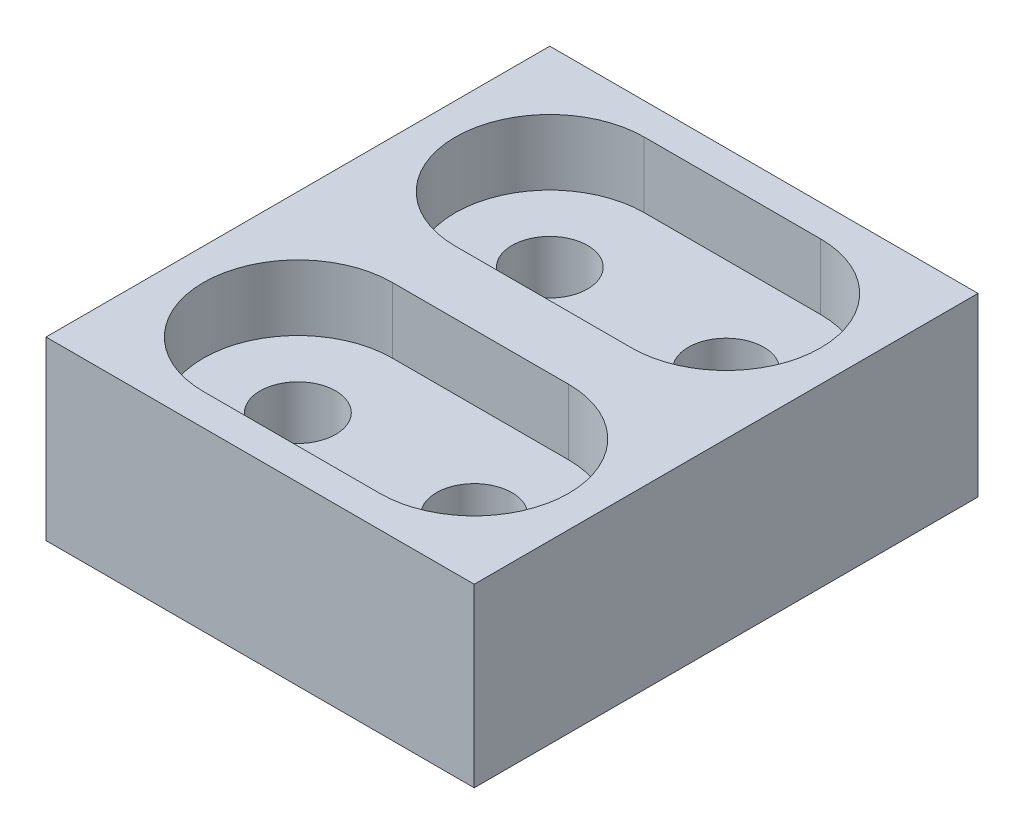
ISO-10303-21;
HEADER;
FILE_DESCRIPTION(('STEP AP214'),'2;1');
FILE_NAME('part.step','',(''),(''),'','','');
FILE_SCHEMA(('AUTOMOTIVE_DESIGN { 1 0 10303 214 1 1 1 1 }'));
ENDSEC;
DATA;
#1=APPLICATION_CONTEXT('core data for automotive mechanical design processes');
#2=APPLICATION_PROTOCOL_DEFINITION('international standard','automotive_design',2000,#1);
#3=PRODUCT_CONTEXT('',#1,'mechanical');
#4=PRODUCT('Part','Part','',(#3));
#5=PRODUCT_RELATED_PRODUCT_CATEGORY('part','',(#4));
#6=PRODUCT_DEFINITION_FORMATION('','',#4);
#7=PRODUCT_DEFINITION_CONTEXT('part definition',#1,'design');
#8=PRODUCT_DEFINITION('design','',#6,#7);
#9=PRODUCT_DEFINITION_SHAPE('','',#8);
#10=(LENGTH_UNIT() NAMED_UNIT(*) SI_UNIT(.MILLI.,.METRE.));
#11=(NAMED_UNIT(*) PLANE_ANGLE_UNIT() SI_UNIT($,.RADIAN.));
#12=(NAMED_UNIT(*) SI_UNIT($,.STERADIAN.) SOLID_ANGLE_UNIT());
#13=UNCERTAINTY_MEASURE_WITH_UNIT(LENGTH_MEASURE(1.E-05),#10,'distance_accuracy_value','');
#14=(GEOMETRIC_REPRESENTATION_CONTEXT(3) GLOBAL_UNCERTAINTY_ASSIGNED_CONTEXT((#13)) GLOBAL_UNIT_ASSIGNED_CONTEXT((#10,
#11,#12)) REPRESENTATION_CONTEXT('',''));
#15=CARTESIAN_POINT('',(0.,0.,0.));
#16=DIRECTION('',(0.,0.,1.));
#17=DIRECTION('',(1.,0.,0.));
#18=AXIS2_PLACEMENT_3D('',#15,#16,#17);
#19=CARTESIAN_POINT('',(-7.,7.,10.));
#20=DIRECTION('',(0.,-1.,0.));
#21=DIRECTION('',(0.,0.,-1.));
#22=AXIS2_PLACEMENT_3D('',#19,#20,#21);
#23=CYLINDRICAL_SURFACE('',#22,1.5);
#24=CARTESIAN_POINT('',(-7.,0.,10.));
#25=DIRECTION('',(0.,1.,0.));
#26=DIRECTION('',(0.,0.,1.));
#27=AXIS2_PLACEMENT_3D('',#24,#25,#26);
#28=CIRCLE('',#27,1.5);
#29=CARTESIAN_POINT('',(-7.,0.,11.5));
#30=VERTEX_POINT('',#29);
#31=EDGE_CURVE('E280',#30,#30,#28,.T.);
#32=ORIENTED_EDGE('',*,*,#31,.F.);
#33=EDGE_LOOP('',(#32));
#34=FACE_BOUND('',#33,.T.);
#35=CARTESIAN_POINT('',(-7.,4.4,10.));
#36=DIRECTION('',(0.,1.,0.));
#37=DIRECTION('',(0.,0.,1.));
#38=AXIS2_PLACEMENT_3D('',#35,#36,#37);
#39=CIRCLE('',#38,1.5);
#40=CARTESIAN_POINT('',(-7.,4.4,11.5));
#41=VERTEX_POINT('',#40);
#42=EDGE_CURVE('E207',#41,#41,#39,.F.);
#43=ORIENTED_EDGE('',*,*,#42,.F.);
#44=EDGE_LOOP('',(#43));
#45=FACE_BOUND('',#44,.T.);
#46=ADVANCED_FACE('F41',(#34,#45),#23,.F.);
#47=CARTESIAN_POINT('',(0.,7.,0.));
#48=DIRECTION('',(0.,-1.,0.));
#49=DIRECTION('',(0.,0.,-1.));
#50=AXIS2_PLACEMENT_3D('',#47,#48,#49);
#51=CYLINDRICAL_SURFACE('',#50,1.5);
#52=CARTESIAN_POINT('',(0.,0.,0.));
#53=DIRECTION('',(0.,1.,0.));
#54=DIRECTION('',(0.,0.,1.));
#55=AXIS2_PLACEMENT_3D('',#52,#53,#54);
#56=CIRCLE('',#55,1.5);
#57=CARTESIAN_POINT('',(0.,0.,1.5));
#58=VERTEX_POINT('',#57);
#59=EDGE_CURVE('E260',#58,#58,#56,.T.);
#60=ORIENTED_EDGE('',*,*,#59,.F.);
#61=EDGE_LOOP('',(#60));
#62=FACE_BOUND('',#61,.T.);
#63=CARTESIAN_POINT('',(0.,4.4,0.));
#64=DIRECTION('',(0.,1.,0.));
#65=DIRECTION('',(0.,0.,1.));
#66=AXIS2_PLACEMENT_3D('',#63,#64,#65);
#67=CIRCLE('',#66,1.5);
#68=CARTESIAN_POINT('',(0.,4.4,1.5));
#69=VERTEX_POINT('',#68);
#70=EDGE_CURVE('E139',#69,#69,#67,.F.);
#71=ORIENTED_EDGE('',*,*,#70,.F.);
#72=EDGE_LOOP('',(#71));
#73=FACE_BOUND('',#72,.T.);
#74=ADVANCED_FACE('F324',(#62,#73),#51,.F.);
#75=CARTESIAN_POINT('',(0.,7.,10.));
#76=DIRECTION('',(0.,-1.,0.));
#77=DIRECTION('',(0.,0.,-1.));
#78=AXIS2_PLACEMENT_3D('',#75,#76,#77);
#79=CYLINDRICAL_SURFACE('',#78,1.5);
#80=CARTESIAN_POINT('',(0.,0.,10.));
#81=DIRECTION('',(0.,1.,0.));
#82=DIRECTION('',(0.,0.,1.));
#83=AXIS2_PLACEMENT_3D('',#80,#81,#82);
#84=CIRCLE('',#83,1.5);
#85=CARTESIAN_POINT('',(0.,0.,11.5));
#86=VERTEX_POINT('',#85);
#87=EDGE_CURVE('E185',#86,#86,#84,.T.);
#88=ORIENTED_EDGE('',*,*,#87,.F.);
#89=EDGE_LOOP('',(#88));
#90=FACE_BOUND('',#89,.T.);
#91=CARTESIAN_POINT('',(0.,4.4,10.));
#92=DIRECTION('',(0.,1.,0.));
#93=DIRECTION('',(0.,0.,1.));
#94=AXIS2_PLACEMENT_3D('',#91,#92,#93);
#95=CIRCLE('',#94,1.5);
#96=CARTESIAN_POINT('',(0.,4.4,11.5));
#97=VERTEX_POINT('',#96);
#98=EDGE_CURVE('E211',#97,#97,#95,.F.);
#99=ORIENTED_EDGE('',*,*,#98,.F.);
#100=EDGE_LOOP('',(#99));
#101=FACE_BOUND('',#100,.T.);
#102=ADVANCED_FACE('F43',(#90,#101),#79,.F.);
#103=CARTESIAN_POINT('',(-7.,7.,0.));
#104=DIRECTION('',(0.,-1.,0.));
#105=DIRECTION('',(0.,0.,-1.));
#106=AXIS2_PLACEMENT_3D('',#103,#104,#105);
#107=CYLINDRICAL_SURFACE('',#106,1.5);
#108=CARTESIAN_POINT('',(-7.,0.,0.));
#109=DIRECTION('',(0.,1.,0.));
#110=DIRECTION('',(0.,0.,1.));
#111=AXIS2_PLACEMENT_3D('',#108,#109,#110);
#112=CIRCLE('',#111,1.5);
#113=CARTESIAN_POINT('',(-7.,0.,1.5));
#114=VERTEX_POINT('',#113);
#115=EDGE_CURVE('E244',#114,#114,#112,.T.);
#116=ORIENTED_EDGE('',*,*,#115,.F.);
#117=EDGE_LOOP('',(#116));
#118=FACE_BOUND('',#117,.T.);
#119=CARTESIAN_POINT('',(-7.,4.4,0.));
#120=DIRECTION('',(0.,1.,0.));
#121=DIRECTION('',(0.,0.,1.));
#122=AXIS2_PLACEMENT_3D('',#119,#120,#121);
#123=CIRCLE('',#122,1.5);
#124=CARTESIAN_POINT('',(-7.,4.4,1.5));
#125=VERTEX_POINT('',#124);
#126=EDGE_CURVE('E166',#125,#125,#123,.F.);
#127=ORIENTED_EDGE('',*,*,#126,.F.);
#128=EDGE_LOOP('',(#127));
#129=FACE_BOUND('',#128,.T.);
#130=ADVANCED_FACE('F314',(#118,#129),#107,.F.);
#131=CARTESIAN_POINT('',(0.,7.,15.));
#132=DIRECTION('',(0.,0.,1.));
#133=DIRECTION('',(1.,0.,0.));
#134=AXIS2_PLACEMENT_3D('',#131,#132,#133);
#135=PLANE('',#134);
#136=DIRECTION('',(-1.,0.,0.));
#137=VECTOR('',#136,1.);
#138=CARTESIAN_POINT('',(0.,0.,15.));
#139=LINE('',#138,#137);
#140=CARTESIAN_POINT('',(5.,0.,15.));
#141=VERTEX_POINT('',#140);
#142=CARTESIAN_POINT('',(-12.,0.,15.));
#143=VERTEX_POINT('',#142);
#144=EDGE_CURVE('E264',#141,#143,#139,.T.);
#145=ORIENTED_EDGE('',*,*,#144,.F.);
#146=DIRECTION('',(0.,-1.,0.));
#147=VECTOR('',#146,1.);
#148=CARTESIAN_POINT('',(5.,7.,15.));
#149=LINE('',#148,#147);
#150=CARTESIAN_POINT('',(5.,7.,15.));
#151=VERTEX_POINT('',#150);
#152=EDGE_CURVE('E11',#151,#141,#149,.T.);
#153=ORIENTED_EDGE('',*,*,#152,.F.);
#154=DIRECTION('',(-1.,0.,0.));
#155=VECTOR('',#154,1.);
#156=CARTESIAN_POINT('',(0.,7.,15.));
#157=LINE('',#156,#155);
#158=CARTESIAN_POINT('',(-12.,7.,15.));
#159=VERTEX_POINT('',#158);
#160=EDGE_CURVE('E239',#151,#159,#157,.T.);
#161=ORIENTED_EDGE('',*,*,#160,.T.);
#162=DIRECTION('',(0.,-1.,0.));
#163=VECTOR('',#162,1.);
#164=CARTESIAN_POINT('',(-12.,7.,15.));
#165=LINE('',#164,#163);
#166=EDGE_CURVE('E256',#159,#143,#165,.T.);
#167=ORIENTED_EDGE('',*,*,#166,.T.);
#168=EDGE_LOOP('',(#145,#153,#161,#167));
#169=FACE_BOUND('',#168,.T.);
#170=ADVANCED_FACE('F312',(#169),#135,.T.);
#171=CARTESIAN_POINT('',(5.,7.,0.));
#172=DIRECTION('',(1.,0.,0.));
#173=DIRECTION('',(0.,0.,-1.));
#174=AXIS2_PLACEMENT_3D('',#171,#172,#173);
#175=PLANE('',#174);
#176=DIRECTION('',(0.,0.,1.));
#177=VECTOR('',#176,1.);
#178=CARTESIAN_POINT('',(5.,0.,0.));
#179=LINE('',#178,#177);
#180=CARTESIAN_POINT('',(5.,0.,-5.));
#181=VERTEX_POINT('',#180);
#182=EDGE_CURVE('E268',#181,#141,#179,.T.);
#183=ORIENTED_EDGE('',*,*,#182,.F.);
#184=DIRECTION('',(0.,-1.,0.));
#185=VECTOR('',#184,1.);
#186=CARTESIAN_POINT('',(5.,7.,-5.));
#187=LINE('',#186,#185);
#188=CARTESIAN_POINT('',(5.,7.,-5.));
#189=VERTEX_POINT('',#188);
#190=EDGE_CURVE('E50',#189,#181,#187,.T.);
#191=ORIENTED_EDGE('',*,*,#190,.F.);
#192=DIRECTION('',(0.,0.,1.));
#193=VECTOR('',#192,1.);
#194=CARTESIAN_POINT('',(5.,7.,0.));
#195=LINE('',#194,#193);
#196=EDGE_CURVE('E243',#189,#151,#195,.T.);
#197=ORIENTED_EDGE('',*,*,#196,.T.);
#198=ORIENTED_EDGE('',*,*,#152,.T.);
#199=EDGE_LOOP('',(#183,#191,#197,#198));
#200=FACE_BOUND('',#199,.T.);
#201=ADVANCED_FACE('F299',(#200),#175,.T.);
#202=CARTESIAN_POINT('',(0.,7.,-5.));
#203=DIRECTION('',(0.,0.,-1.));
#204=DIRECTION('',(-1.,0.,0.));
#205=AXIS2_PLACEMENT_3D('',#202,#203,#204);
#206=PLANE('',#205);
#207=DIRECTION('',(1.,0.,0.));
#208=VECTOR('',#207,1.);
#209=CARTESIAN_POINT('',(0.,0.,-5.));
#210=LINE('',#209,#208);
#211=CARTESIAN_POINT('',(-12.,0.,-5.));
#212=VERTEX_POINT('',#211);
#213=EDGE_CURVE('E272',#212,#181,#210,.T.);
#214=ORIENTED_EDGE('',*,*,#213,.F.);
#215=DIRECTION('',(0.,-1.,0.));
#216=VECTOR('',#215,1.);
#217=CARTESIAN_POINT('',(-12.,7.,-5.));
#218=LINE('',#217,#216);
#219=CARTESIAN_POINT('',(-12.,7.,-5.));
#220=VERTEX_POINT('',#219);
#221=EDGE_CURVE('E289',#220,#212,#218,.T.);
#222=ORIENTED_EDGE('',*,*,#221,.F.);
#223=DIRECTION('',(1.,0.,0.));
#224=VECTOR('',#223,1.);
#225=CARTESIAN_POINT('',(0.,7.,-5.));
#226=LINE('',#225,#224);
#227=EDGE_CURVE('E248',#220,#189,#226,.T.);
#228=ORIENTED_EDGE('',*,*,#227,.T.);
#229=ORIENTED_EDGE('',*,*,#190,.T.);
#230=EDGE_LOOP('',(#214,#222,#228,#229));
#231=FACE_BOUND('',#230,.T.);
#232=ADVANCED_FACE('F295',(#231),#206,.T.);
#233=CARTESIAN_POINT('',(-12.,7.,0.));
#234=DIRECTION('',(-1.,0.,0.));
#235=DIRECTION('',(0.,0.,1.));
#236=AXIS2_PLACEMENT_3D('',#233,#234,#235);
#237=PLANE('',#236);
#238=DIRECTION('',(0.,0.,-1.));
#239=VECTOR('',#238,1.);
#240=CARTESIAN_POINT('',(-12.,0.,0.));
#241=LINE('',#240,#239);
#242=EDGE_CURVE('E276',#143,#212,#241,.T.);
#243=ORIENTED_EDGE('',*,*,#242,.F.);
#244=ORIENTED_EDGE('',*,*,#166,.F.);
#245=DIRECTION('',(0.,0.,-1.));
#246=VECTOR('',#245,1.);
#247=CARTESIAN_POINT('',(-12.,7.,0.));
#248=LINE('',#247,#246);
#249=EDGE_CURVE('E252',#159,#220,#248,.T.);
#250=ORIENTED_EDGE('',*,*,#249,.T.);
#251=ORIENTED_EDGE('',*,*,#221,.T.);
#252=EDGE_LOOP('',(#243,#244,#250,#251));
#253=FACE_BOUND('',#252,.T.);
#254=ADVANCED_FACE('F306',(#253),#237,.T.);
#255=CARTESIAN_POINT('',(0.,7.,0.));
#256=DIRECTION('',(0.,1.,0.));
#257=DIRECTION('',(0.,0.,1.));
#258=AXIS2_PLACEMENT_3D('',#255,#256,#257);
#259=PLANE('',#258);
#260=DIRECTION('',(1.,0.,0.));
#261=VECTOR('',#260,1.);
#262=CARTESIAN_POINT('',(0.,7.,3.75));
#263=LINE('',#262,#261);
#264=CARTESIAN_POINT('',(-7.,7.,3.75));
#265=VERTEX_POINT('',#264);
#266=CARTESIAN_POINT('',(0.,7.,3.75));
#267=VERTEX_POINT('',#266);
#268=EDGE_CURVE('E57',#265,#267,#263,.T.);
#269=ORIENTED_EDGE('',*,*,#268,.F.);
#270=CARTESIAN_POINT('',(-7.,7.,0.));
#271=DIRECTION('',(0.,1.,0.));
#272=DIRECTION('',(0.,0.,1.));
#273=AXIS2_PLACEMENT_3D('',#270,#271,#272);
#274=CIRCLE('',#273,3.75);
#275=CARTESIAN_POINT('',(-7.,7.,-3.75));
#276=VERTEX_POINT('',#275);
#277=EDGE_CURVE('E155',#276,#265,#274,.T.);
#278=ORIENTED_EDGE('',*,*,#277,.F.);
#279=DIRECTION('',(1.,0.,0.));
#280=VECTOR('',#279,1.);
#281=CARTESIAN_POINT('',(0.,7.,-3.75));
#282=LINE('',#281,#280);
#283=CARTESIAN_POINT('',(0.,7.,-3.75));
#284=VERTEX_POINT('',#283);
#285=EDGE_CURVE('E159',#276,#284,#282,.T.);
#286=ORIENTED_EDGE('',*,*,#285,.T.);
#287=CARTESIAN_POINT('',(0.,7.,0.));
#288=DIRECTION('',(0.,1.,0.));
#289=DIRECTION('',(0.,0.,1.));
#290=AXIS2_PLACEMENT_3D('',#287,#288,#289);
#291=CIRCLE('',#290,3.75);
#292=EDGE_CURVE('E175',#267,#284,#291,.T.);
#293=ORIENTED_EDGE('',*,*,#292,.F.);
#294=EDGE_LOOP('',(#269,#278,#286,#293));
#295=FACE_BOUND('',#294,.T.);
#296=DIRECTION('',(1.,0.,0.));
#297=VECTOR('',#296,1.);
#298=CARTESIAN_POINT('',(0.,7.,13.75));
#299=LINE('',#298,#297);
#300=CARTESIAN_POINT('',(-7.,7.,13.75));
#301=VERTEX_POINT('',#300);
#302=CARTESIAN_POINT('',(0.,7.,13.75));
#303=VERTEX_POINT('',#302);
#304=EDGE_CURVE('E65',#301,#303,#299,.T.);
#305=ORIENTED_EDGE('',*,*,#304,.F.);
#306=CARTESIAN_POINT('',(-7.,7.,10.));
#307=DIRECTION('',(0.,1.,0.));
#308=DIRECTION('',(0.,0.,1.));
#309=AXIS2_PLACEMENT_3D('',#306,#307,#308);
#310=CIRCLE('',#309,3.75);
#311=CARTESIAN_POINT('',(-7.,7.,6.25));
#312=VERTEX_POINT('',#311);
#313=EDGE_CURVE('E196',#312,#301,#310,.T.);
#314=ORIENTED_EDGE('',*,*,#313,.F.);
#315=DIRECTION('',(1.,0.,0.));
#316=VECTOR('',#315,1.);
#317=CARTESIAN_POINT('',(0.,7.,6.25));
#318=LINE('',#317,#316);
#319=CARTESIAN_POINT('',(0.,7.,6.25));
#320=VERTEX_POINT('',#319);
#321=EDGE_CURVE('E222',#312,#320,#318,.T.);
#322=ORIENTED_EDGE('',*,*,#321,.T.);
#323=CARTESIAN_POINT('',(0.,7.,10.));
#324=DIRECTION('',(0.,1.,0.));
#325=DIRECTION('',(0.,0.,1.));
#326=AXIS2_PLACEMENT_3D('',#323,#324,#325);
#327=CIRCLE('',#326,3.75);
#328=EDGE_CURVE('E218',#303,#320,#327,.T.);
#329=ORIENTED_EDGE('',*,*,#328,.F.);
#330=EDGE_LOOP('',(#305,#314,#322,#329));
#331=FACE_BOUND('',#330,.T.);
#332=ORIENTED_EDGE('',*,*,#160,.F.);
#333=ORIENTED_EDGE('',*,*,#196,.F.);
#334=ORIENTED_EDGE('',*,*,#227,.F.);
#335=ORIENTED_EDGE('',*,*,#249,.F.);
#336=EDGE_LOOP('',(#332,#333,#334,#335));
#337=FACE_BOUND('',#336,.T.);
#338=ADVANCED_FACE('F310',(#295,#331,#337),#259,.T.);
#339=CARTESIAN_POINT('',(0.,0.,0.));
#340=DIRECTION('',(0.,1.,0.));
#341=DIRECTION('',(0.,0.,1.));
#342=AXIS2_PLACEMENT_3D('',#339,#340,#341);
#343=PLANE('',#342);
#344=ORIENTED_EDGE('',*,*,#87,.T.);
#345=EDGE_LOOP('',(#344));
#346=FACE_BOUND('',#345,.T.);
#347=ORIENTED_EDGE('',*,*,#59,.T.);
#348=EDGE_LOOP('',(#347));
#349=FACE_BOUND('',#348,.T.);
#350=ORIENTED_EDGE('',*,*,#144,.T.);
#351=ORIENTED_EDGE('',*,*,#242,.T.);
#352=ORIENTED_EDGE('',*,*,#213,.T.);
#353=ORIENTED_EDGE('',*,*,#182,.T.);
#354=EDGE_LOOP('',(#350,#351,#352,#353));
#355=FACE_BOUND('',#354,.T.);
#356=ORIENTED_EDGE('',*,*,#31,.T.);
#357=EDGE_LOOP('',(#356));
#358=FACE_BOUND('',#357,.T.);
#359=ORIENTED_EDGE('',*,*,#115,.T.);
#360=EDGE_LOOP('',(#359));
#361=FACE_BOUND('',#360,.T.);
#362=ADVANCED_FACE('F302',(#346,#349,#355,#358,#361),#343,.F.);
#363=CARTESIAN_POINT('',(0.,4.4,13.75));
#364=DIRECTION('',(0.,0.,1.));
#365=DIRECTION('',(1.,0.,0.));
#366=AXIS2_PLACEMENT_3D('',#363,#364,#365);
#367=PLANE('',#366);
#368=ORIENTED_EDGE('',*,*,#304,.T.);
#369=DIRECTION('',(0.,1.,0.));
#370=VECTOR('',#369,1.);
#371=CARTESIAN_POINT('',(0.,4.4,13.75));
#372=LINE('',#371,#370);
#373=CARTESIAN_POINT('',(0.,4.4,13.75));
#374=VERTEX_POINT('',#373);
#375=EDGE_CURVE('E215',#374,#303,#372,.T.);
#376=ORIENTED_EDGE('',*,*,#375,.F.);
#377=DIRECTION('',(1.,0.,0.));
#378=VECTOR('',#377,1.);
#379=CARTESIAN_POINT('',(0.,4.4,13.75));
#380=LINE('',#379,#378);
#381=CARTESIAN_POINT('',(-7.,4.4,13.75));
#382=VERTEX_POINT('',#381);
#383=EDGE_CURVE('E191',#382,#374,#380,.T.);
#384=ORIENTED_EDGE('',*,*,#383,.F.);
#385=DIRECTION('',(0.,1.,0.));
#386=VECTOR('',#385,1.);
#387=CARTESIAN_POINT('',(-7.,4.4,13.75));
#388=LINE('',#387,#386);
#389=EDGE_CURVE('E176',#382,#301,#388,.T.);
#390=ORIENTED_EDGE('',*,*,#389,.T.);
#391=EDGE_LOOP('',(#368,#376,#384,#390));
#392=FACE_BOUND('',#391,.T.);
#393=ADVANCED_FACE('F361',(#392),#367,.F.);
#394=CARTESIAN_POINT('',(-7.,4.4,10.));
#395=DIRECTION('',(0.,1.,0.));
#396=DIRECTION('',(0.,0.,1.));
#397=AXIS2_PLACEMENT_3D('',#394,#395,#396);
#398=CYLINDRICAL_SURFACE('',#397,3.75);
#399=ORIENTED_EDGE('',*,*,#313,.T.);
#400=ORIENTED_EDGE('',*,*,#389,.F.);
#401=CARTESIAN_POINT('',(-7.,4.4,10.));
#402=DIRECTION('',(0.,1.,0.));
#403=DIRECTION('',(0.,0.,1.));
#404=AXIS2_PLACEMENT_3D('',#401,#402,#403);
#405=CIRCLE('',#404,3.75);
#406=CARTESIAN_POINT('',(-7.,4.4,6.25));
#407=VERTEX_POINT('',#406);
#408=EDGE_CURVE('E203',#407,#382,#405,.T.);
#409=ORIENTED_EDGE('',*,*,#408,.F.);
#410=DIRECTION('',(0.,1.,0.));
#411=VECTOR('',#410,1.);
#412=CARTESIAN_POINT('',(-7.,4.4,6.25));
#413=LINE('',#412,#411);
#414=EDGE_CURVE('E231',#407,#312,#413,.T.);
#415=ORIENTED_EDGE('',*,*,#414,.T.);
#416=EDGE_LOOP('',(#399,#400,#409,#415));
#417=FACE_BOUND('',#416,.T.);
#418=ADVANCED_FACE('F367',(#417),#398,.F.);
#419=CARTESIAN_POINT('',(0.,4.4,6.25));
#420=DIRECTION('',(0.,0.,1.));
#421=DIRECTION('',(1.,0.,0.));
#422=AXIS2_PLACEMENT_3D('',#419,#420,#421);
#423=PLANE('',#422);
#424=ORIENTED_EDGE('',*,*,#321,.F.);
#425=ORIENTED_EDGE('',*,*,#414,.F.);
#426=DIRECTION('',(1.,0.,0.));
#427=VECTOR('',#426,1.);
#428=CARTESIAN_POINT('',(0.,4.4,6.25));
#429=LINE('',#428,#427);
#430=CARTESIAN_POINT('',(0.,4.4,6.25));
#431=VERTEX_POINT('',#430);
#432=EDGE_CURVE('E200',#407,#431,#429,.T.);
#433=ORIENTED_EDGE('',*,*,#432,.T.);
#434=DIRECTION('',(0.,1.,0.));
#435=VECTOR('',#434,1.);
#436=CARTESIAN_POINT('',(0.,4.4,6.25));
#437=LINE('',#436,#435);
#438=EDGE_CURVE('E234',#431,#320,#437,.T.);
#439=ORIENTED_EDGE('',*,*,#438,.T.);
#440=EDGE_LOOP('',(#424,#425,#433,#439));
#441=FACE_BOUND('',#440,.T.);
#442=ADVANCED_FACE('F374',(#441),#423,.T.);
#443=CARTESIAN_POINT('',(0.,4.4,10.));
#444=DIRECTION('',(0.,1.,0.));
#445=DIRECTION('',(0.,0.,1.));
#446=AXIS2_PLACEMENT_3D('',#443,#444,#445);
#447=CYLINDRICAL_SURFACE('',#446,3.75);
#448=ORIENTED_EDGE('',*,*,#328,.T.);
#449=ORIENTED_EDGE('',*,*,#438,.F.);
#450=CARTESIAN_POINT('',(0.,4.4,10.));
#451=DIRECTION('',(0.,1.,0.));
#452=DIRECTION('',(0.,0.,1.));
#453=AXIS2_PLACEMENT_3D('',#450,#451,#452);
#454=CIRCLE('',#453,3.75);
#455=EDGE_CURVE('E195',#374,#431,#454,.T.);
#456=ORIENTED_EDGE('',*,*,#455,.F.);
#457=ORIENTED_EDGE('',*,*,#375,.T.);
#458=EDGE_LOOP('',(#448,#449,#456,#457));
#459=FACE_BOUND('',#458,.T.);
#460=ADVANCED_FACE('F382',(#459),#447,.F.);
#461=CARTESIAN_POINT('',(0.,4.4,0.));
#462=DIRECTION('',(0.,1.,0.));
#463=DIRECTION('',(0.,0.,1.));
#464=AXIS2_PLACEMENT_3D('',#461,#462,#463);
#465=PLANE('',#464);
#466=ORIENTED_EDGE('',*,*,#383,.T.);
#467=ORIENTED_EDGE('',*,*,#455,.T.);
#468=ORIENTED_EDGE('',*,*,#432,.F.);
#469=ORIENTED_EDGE('',*,*,#408,.T.);
#470=EDGE_LOOP('',(#466,#467,#468,#469));
#471=FACE_BOUND('',#470,.T.);
#472=ORIENTED_EDGE('',*,*,#42,.T.);
#473=EDGE_LOOP('',(#472));
#474=FACE_BOUND('',#473,.T.);
#475=ORIENTED_EDGE('',*,*,#98,.T.);
#476=EDGE_LOOP('',(#475));
#477=FACE_BOUND('',#476,.T.);
#478=ADVANCED_FACE('F390',(#471,#474,#477),#465,.T.);
#479=CARTESIAN_POINT('',(0.,4.4,3.75));
#480=DIRECTION('',(0.,0.,1.));
#481=DIRECTION('',(1.,0.,0.));
#482=AXIS2_PLACEMENT_3D('',#479,#480,#481);
#483=PLANE('',#482);
#484=ORIENTED_EDGE('',*,*,#268,.T.);
#485=DIRECTION('',(0.,1.,0.));
#486=VECTOR('',#485,1.);
#487=CARTESIAN_POINT('',(0.,4.4,3.75));
#488=LINE('',#487,#486);
#489=CARTESIAN_POINT('',(0.,4.4,3.75));
#490=VERTEX_POINT('',#489);
#491=EDGE_CURVE('E128',#490,#267,#488,.T.);
#492=ORIENTED_EDGE('',*,*,#491,.F.);
#493=DIRECTION('',(1.,0.,0.));
#494=VECTOR('',#493,1.);
#495=CARTESIAN_POINT('',(0.,4.4,3.75));
#496=LINE('',#495,#494);
#497=CARTESIAN_POINT('',(-7.,4.4,3.75));
#498=VERTEX_POINT('',#497);
#499=EDGE_CURVE('E132',#498,#490,#496,.T.);
#500=ORIENTED_EDGE('',*,*,#499,.F.);
#501=DIRECTION('',(0.,1.,0.));
#502=VECTOR('',#501,1.);
#503=CARTESIAN_POINT('',(-7.,4.4,3.75));
#504=LINE('',#503,#502);
#505=EDGE_CURVE('E182',#498,#265,#504,.T.);
#506=ORIENTED_EDGE('',*,*,#505,.T.);
#507=EDGE_LOOP('',(#484,#492,#500,#506));
#508=FACE_BOUND('',#507,.T.);
#509=ADVANCED_FACE('F130',(#508),#483,.F.);
#510=CARTESIAN_POINT('',(-7.,4.4,0.));
#511=DIRECTION('',(0.,1.,0.));
#512=DIRECTION('',(0.,0.,1.));
#513=AXIS2_PLACEMENT_3D('',#510,#511,#512);
#514=CYLINDRICAL_SURFACE('',#513,3.75);
#515=ORIENTED_EDGE('',*,*,#277,.T.);
#516=ORIENTED_EDGE('',*,*,#505,.F.);
#517=CARTESIAN_POINT('',(-7.,4.4,0.));
#518=DIRECTION('',(0.,1.,0.));
#519=DIRECTION('',(0.,0.,1.));
#520=AXIS2_PLACEMENT_3D('',#517,#518,#519);
#521=CIRCLE('',#520,3.75);
#522=CARTESIAN_POINT('',(-7.,4.4,-3.75));
#523=VERTEX_POINT('',#522);
#524=EDGE_CURVE('E153',#523,#498,#521,.T.);
#525=ORIENTED_EDGE('',*,*,#524,.F.);
#526=DIRECTION('',(0.,1.,0.));
#527=VECTOR('',#526,1.);
#528=CARTESIAN_POINT('',(-7.,4.4,-3.75));
#529=LINE('',#528,#527);
#530=EDGE_CURVE('E186',#523,#276,#529,.T.);
#531=ORIENTED_EDGE('',*,*,#530,.T.);
#532=EDGE_LOOP('',(#515,#516,#525,#531));
#533=FACE_BOUND('',#532,.T.);
#534=ADVANCED_FACE('F405',(#533),#514,.F.);
#535=CARTESIAN_POINT('',(0.,4.4,-3.75));
#536=DIRECTION('',(0.,0.,1.));
#537=DIRECTION('',(1.,0.,0.));
#538=AXIS2_PLACEMENT_3D('',#535,#536,#537);
#539=PLANE('',#538);
#540=ORIENTED_EDGE('',*,*,#285,.F.);
#541=ORIENTED_EDGE('',*,*,#530,.F.);
#542=DIRECTION('',(1.,0.,0.));
#543=VECTOR('',#542,1.);
#544=CARTESIAN_POINT('',(0.,4.4,-3.75));
#545=LINE('',#544,#543);
#546=CARTESIAN_POINT('',(0.,4.4,-3.75));
#547=VERTEX_POINT('',#546);
#548=EDGE_CURVE('E148',#523,#547,#545,.T.);
#549=ORIENTED_EDGE('',*,*,#548,.T.);
#550=DIRECTION('',(0.,1.,0.));
#551=VECTOR('',#550,1.);
#552=CARTESIAN_POINT('',(0.,4.4,-3.75));
#553=LINE('',#552,#551);
#554=EDGE_CURVE('E138',#547,#284,#553,.T.);
#555=ORIENTED_EDGE('',*,*,#554,.T.);
#556=EDGE_LOOP('',(#540,#541,#549,#555));
#557=FACE_BOUND('',#556,.T.);
#558=ADVANCED_FACE('F412',(#557),#539,.T.);
#559=CARTESIAN_POINT('',(0.,4.4,0.));
#560=DIRECTION('',(0.,1.,0.));
#561=DIRECTION('',(0.,0.,1.));
#562=AXIS2_PLACEMENT_3D('',#559,#560,#561);
#563=CYLINDRICAL_SURFACE('',#562,3.75);
#564=ORIENTED_EDGE('',*,*,#292,.T.);
#565=ORIENTED_EDGE('',*,*,#554,.F.);
#566=CARTESIAN_POINT('',(0.,4.4,0.));
#567=DIRECTION('',(0.,1.,0.));
#568=DIRECTION('',(0.,0.,1.));
#569=AXIS2_PLACEMENT_3D('',#566,#567,#568);
#570=CIRCLE('',#569,3.75);
#571=EDGE_CURVE('E143',#490,#547,#570,.T.);
#572=ORIENTED_EDGE('',*,*,#571,.F.);
#573=ORIENTED_EDGE('',*,*,#491,.T.);
#574=EDGE_LOOP('',(#564,#565,#572,#573));
#575=FACE_BOUND('',#574,.T.);
#576=ADVANCED_FACE('F144',(#575),#563,.F.);
#577=CARTESIAN_POINT('',(0.,4.4,0.));
#578=DIRECTION('',(0.,1.,0.));
#579=DIRECTION('',(0.,0.,1.));
#580=AXIS2_PLACEMENT_3D('',#577,#578,#579);
#581=PLANE('',#580);
#582=ORIENTED_EDGE('',*,*,#499,.T.);
#583=ORIENTED_EDGE('',*,*,#571,.T.);
#584=ORIENTED_EDGE('',*,*,#548,.F.);
#585=ORIENTED_EDGE('',*,*,#524,.T.);
#586=EDGE_LOOP('',(#582,#583,#584,#585));
#587=FACE_BOUND('',#586,.T.);
#588=ORIENTED_EDGE('',*,*,#126,.T.);
#589=EDGE_LOOP('',(#588));
#590=FACE_BOUND('',#589,.T.);
#591=ORIENTED_EDGE('',*,*,#70,.T.);
#592=EDGE_LOOP('',(#591));
#593=FACE_BOUND('',#592,.T.);
#594=ADVANCED_FACE('F150',(#587,#590,#593),#581,.T.);
#595=CLOSED_SHELL('',(#46,#74,#102,#130,#170,#201,#232,#254,#338,#362,#393,#418,#442,#460,#478,
#509,#534,#558,#576,#594));
#596=MANIFOLD_SOLID_BREP('B2',#595);
#597=ADVANCED_BREP_SHAPE_REPRESENTATION('',(#18,#596),#14);
#598=SHAPE_DEFINITION_REPRESENTATION(#9,#597);
ENDSEC;
END-ISO-10303-21;
